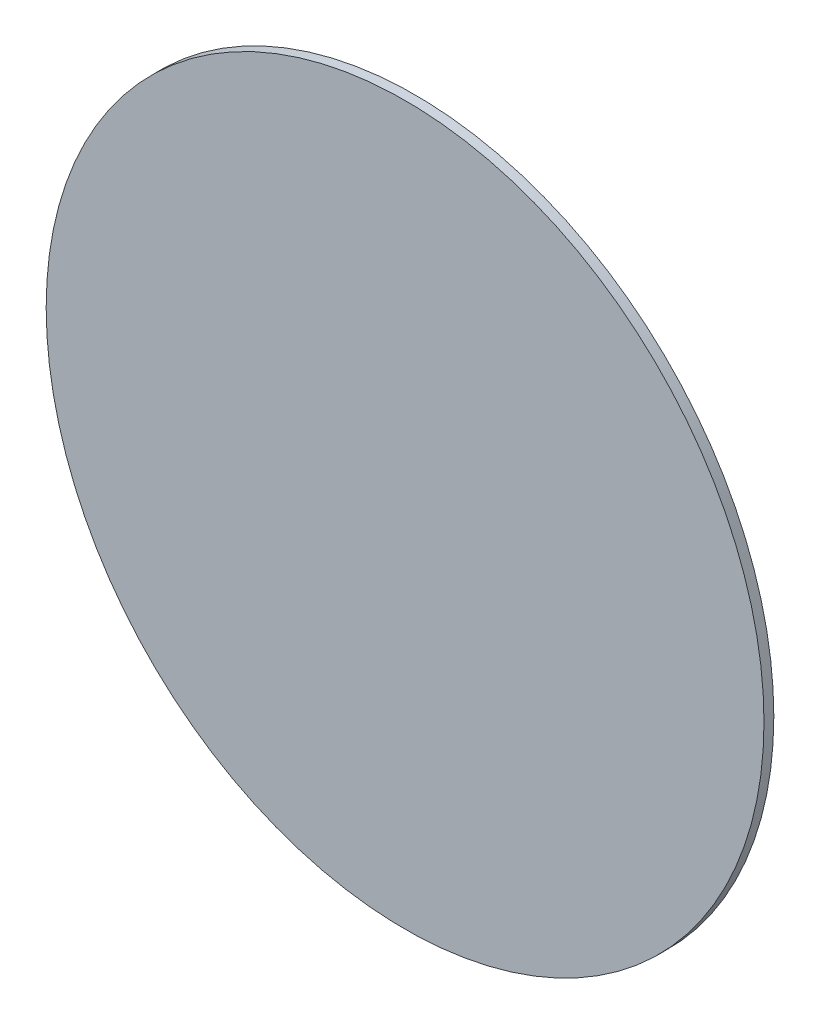
ISO-10303-21;
HEADER;
FILE_DESCRIPTION(('STEP AP214'),'2;1');
FILE_NAME('part.step','',(''),(''),'','','');
FILE_SCHEMA(('AUTOMOTIVE_DESIGN { 1 0 10303 214 1 1 1 1 }'));
ENDSEC;
DATA;
#1=APPLICATION_CONTEXT('core data for automotive mechanical design processes');
#2=APPLICATION_PROTOCOL_DEFINITION('international standard','automotive_design',2000,#1);
#3=PRODUCT_CONTEXT('',#1,'mechanical');
#4=PRODUCT('Part','Part','',(#3));
#5=PRODUCT_RELATED_PRODUCT_CATEGORY('part','',(#4));
#6=PRODUCT_DEFINITION_FORMATION('','',#4);
#7=PRODUCT_DEFINITION_CONTEXT('part definition',#1,'design');
#8=PRODUCT_DEFINITION('design','',#6,#7);
#9=PRODUCT_DEFINITION_SHAPE('','',#8);
#10=(LENGTH_UNIT() NAMED_UNIT(*) SI_UNIT(.MILLI.,.METRE.));
#11=(NAMED_UNIT(*) PLANE_ANGLE_UNIT() SI_UNIT($,.RADIAN.));
#12=(NAMED_UNIT(*) SI_UNIT($,.STERADIAN.) SOLID_ANGLE_UNIT());
#13=UNCERTAINTY_MEASURE_WITH_UNIT(LENGTH_MEASURE(1.E-05),#10,'distance_accuracy_value','');
#14=(GEOMETRIC_REPRESENTATION_CONTEXT(3) GLOBAL_UNCERTAINTY_ASSIGNED_CONTEXT((#13)) GLOBAL_UNIT_ASSIGNED_CONTEXT((#10,
#11,#12)) REPRESENTATION_CONTEXT('',''));
#15=CARTESIAN_POINT('',(0.,0.,0.));
#16=DIRECTION('',(0.,0.,1.));
#17=DIRECTION('',(1.,0.,0.));
#18=AXIS2_PLACEMENT_3D('',#15,#16,#17);
#19=CARTESIAN_POINT('',(-1.17961196366423E-13,33.3375,22.225));
#20=DIRECTION('',(0.,0.,-1.));
#21=DIRECTION('',(-1.,0.,0.));
#22=AXIS2_PLACEMENT_3D('',#19,#20,#21);
#23=CYLINDRICAL_SURFACE('',#22,115.8875);
#24=CARTESIAN_POINT('',(-1.17961196366423E-13,33.3375,22.225));
#25=DIRECTION('',(0.,0.,1.));
#26=DIRECTION('',(1.,0.,0.));
#27=AXIS2_PLACEMENT_3D('',#24,#25,#26);
#28=CIRCLE('',#27,115.8875);
#29=CARTESIAN_POINT('',(115.8875,33.3375,22.225));
#30=VERTEX_POINT('',#29);
#31=EDGE_CURVE('E10',#30,#30,#28,.T.);
#32=ORIENTED_EDGE('',*,*,#31,.F.);
#33=EDGE_LOOP('',(#32));
#34=FACE_BOUND('',#33,.T.);
#35=CARTESIAN_POINT('',(-1.17961196366423E-13,33.3375,19.05));
#36=DIRECTION('',(0.,0.,1.));
#37=DIRECTION('',(1.,0.,0.));
#38=AXIS2_PLACEMENT_3D('',#35,#36,#37);
#39=CIRCLE('',#38,115.8875);
#40=CARTESIAN_POINT('',(115.8875,33.3375,19.05));
#41=VERTEX_POINT('',#40);
#42=EDGE_CURVE('E32',#41,#41,#39,.T.);
#43=ORIENTED_EDGE('',*,*,#42,.T.);
#44=EDGE_LOOP('',(#43));
#45=FACE_BOUND('',#44,.T.);
#46=ADVANCED_FACE('F29',(#34,#45),#23,.T.);
#47=CARTESIAN_POINT('',(-1.17961196366423E-13,33.3375,22.225));
#48=DIRECTION('',(0.,0.,1.));
#49=DIRECTION('',(1.,0.,0.));
#50=AXIS2_PLACEMENT_3D('',#47,#48,#49);
#51=PLANE('',#50);
#52=ORIENTED_EDGE('',*,*,#31,.T.);
#53=EDGE_LOOP('',(#52));
#54=FACE_BOUND('',#53,.T.);
#55=ADVANCED_FACE('F44',(#54),#51,.T.);
#56=CARTESIAN_POINT('',(-1.17961196366423E-13,33.3375,19.05));
#57=DIRECTION('',(0.,0.,1.));
#58=DIRECTION('',(1.,0.,0.));
#59=AXIS2_PLACEMENT_3D('',#56,#57,#58);
#60=PLANE('',#59);
#61=ORIENTED_EDGE('',*,*,#42,.F.);
#62=EDGE_LOOP('',(#61));
#63=FACE_BOUND('',#62,.T.);
#64=ADVANCED_FACE('F42',(#63),#60,.F.);
#65=CLOSED_SHELL('',(#46,#55,#64));
#66=MANIFOLD_SOLID_BREP('B2',#65);
#67=ADVANCED_BREP_SHAPE_REPRESENTATION('',(#18,#66),#14);
#68=SHAPE_DEFINITION_REPRESENTATION(#9,#67);
ENDSEC;
END-ISO-10303-21;
